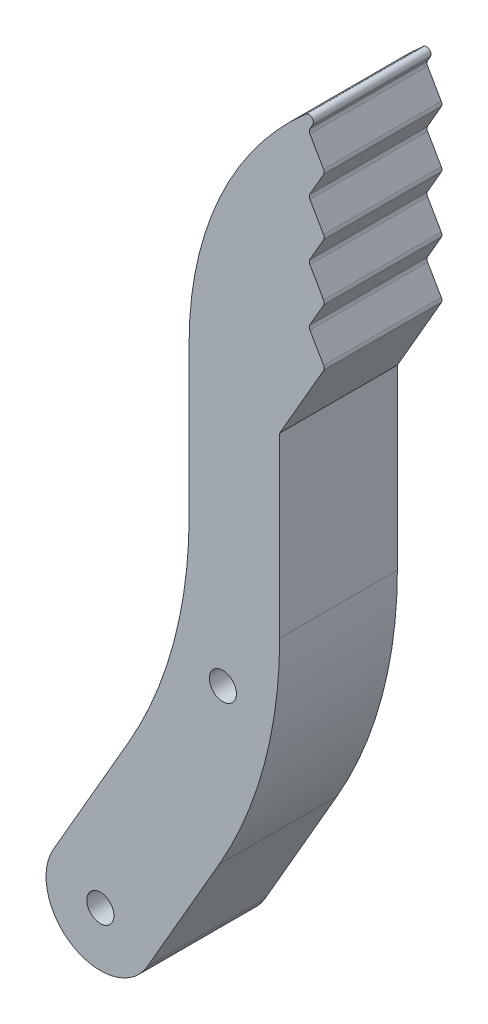
ISO-10303-21;
HEADER;
FILE_DESCRIPTION(('STEP AP214'),'2;1');
FILE_NAME('part.step','',(''),(''),'','','');
FILE_SCHEMA(('AUTOMOTIVE_DESIGN { 1 0 10303 214 1 1 1 1 }'));
ENDSEC;
DATA;
#1=APPLICATION_CONTEXT('core data for automotive mechanical design processes');
#2=APPLICATION_PROTOCOL_DEFINITION('international standard','automotive_design',2000,#1);
#3=PRODUCT_CONTEXT('',#1,'mechanical');
#4=PRODUCT('Part','Part','',(#3));
#5=PRODUCT_RELATED_PRODUCT_CATEGORY('part','',(#4));
#6=PRODUCT_DEFINITION_FORMATION('','',#4);
#7=PRODUCT_DEFINITION_CONTEXT('part definition',#1,'design');
#8=PRODUCT_DEFINITION('design','',#6,#7);
#9=PRODUCT_DEFINITION_SHAPE('','',#8);
#10=(LENGTH_UNIT() NAMED_UNIT(*) SI_UNIT(.MILLI.,.METRE.));
#11=(NAMED_UNIT(*) PLANE_ANGLE_UNIT() SI_UNIT($,.RADIAN.));
#12=(NAMED_UNIT(*) SI_UNIT($,.STERADIAN.) SOLID_ANGLE_UNIT());
#13=UNCERTAINTY_MEASURE_WITH_UNIT(LENGTH_MEASURE(1.E-05),#10,'distance_accuracy_value','');
#14=(GEOMETRIC_REPRESENTATION_CONTEXT(3) GLOBAL_UNCERTAINTY_ASSIGNED_CONTEXT((#13)) GLOBAL_UNIT_ASSIGNED_CONTEXT((#10,
#11,#12)) REPRESENTATION_CONTEXT('',''));
#15=CARTESIAN_POINT('',(0.,0.,0.));
#16=DIRECTION('',(0.,0.,1.));
#17=DIRECTION('',(1.,0.,0.));
#18=AXIS2_PLACEMENT_3D('',#15,#16,#17);
#19=CARTESIAN_POINT('',(3.47243186433413,-2.00480947161596,6.5));
#20=DIRECTION('',(0.866025403784437,-0.500000000000003,0.));
#21=DIRECTION('',(0.500000000000003,0.866025403784437,0.));
#22=AXIS2_PLACEMENT_3D('',#19,#20,#21);
#23=PLANE('',#22);
#24=DIRECTION('',(-0.500000000000003,-0.866025403784437,0.));
#25=VECTOR('',#24,1.);
#26=CARTESIAN_POINT('',(3.47243186433413,-2.00480947161596,-6.5));
#27=LINE('',#26,#25);
#28=CARTESIAN_POINT('',(-11.6987298107781,-28.2820323027519,-6.5));
#29=VERTEX_POINT('',#28);
#30=CARTESIAN_POINT('',(-19.6076951545882,-41.9807621135323,-6.5));
#31=VERTEX_POINT('',#30);
#32=EDGE_CURVE('E219',#29,#31,#27,.T.);
#33=ORIENTED_EDGE('',*,*,#32,.F.);
#34=DIRECTION('',(0.,0.,-1.));
#35=VECTOR('',#34,1.);
#36=CARTESIAN_POINT('',(-11.6987298107781,-28.2820323027519,6.5));
#37=LINE('',#36,#35);
#38=CARTESIAN_POINT('',(-11.6987298107781,-28.2820323027519,6.5));
#39=VERTEX_POINT('',#38);
#40=EDGE_CURVE('E213',#39,#29,#37,.T.);
#41=ORIENTED_EDGE('',*,*,#40,.F.);
#42=DIRECTION('',(-0.500000000000003,-0.866025403784437,0.));
#43=VECTOR('',#42,1.);
#44=CARTESIAN_POINT('',(3.47243186433413,-2.00480947161596,6.5));
#45=LINE('',#44,#43);
#46=CARTESIAN_POINT('',(-19.6076951545882,-41.9807621135323,6.5));
#47=VERTEX_POINT('',#46);
#48=EDGE_CURVE('E216',#39,#47,#45,.T.);
#49=ORIENTED_EDGE('',*,*,#48,.T.);
#50=DIRECTION('',(0.,0.,-1.));
#51=VECTOR('',#50,1.);
#52=CARTESIAN_POINT('',(-19.6076951545882,-41.9807621135323,6.5));
#53=LINE('',#52,#51);
#54=EDGE_CURVE('E283',#47,#31,#53,.T.);
#55=ORIENTED_EDGE('',*,*,#54,.T.);
#56=EDGE_LOOP('',(#33,#41,#49,#55));
#57=FACE_BOUND('',#56,.T.);
#58=ADVANCED_FACE('F38',(#57),#23,.T.);
#59=CARTESIAN_POINT('',(-54.9999999999996,-3.28203230275342,6.5));
#60=DIRECTION('',(0.,0.,-1.));
#61=DIRECTION('',(-1.,0.,0.));
#62=AXIS2_PLACEMENT_3D('',#59,#60,#61);
#63=CYLINDRICAL_SURFACE('',#62,49.9999999999992);
#64=CARTESIAN_POINT('',(-54.9999999999996,-3.28203230275342,-6.5));
#65=DIRECTION('',(0.,0.,1.));
#66=DIRECTION('',(1.,0.,0.));
#67=AXIS2_PLACEMENT_3D('',#64,#65,#66);
#68=CIRCLE('',#67,49.9999999999992);
#69=CARTESIAN_POINT('',(-4.99999999999998,-3.28203230275191,-6.5));
#70=VERTEX_POINT('',#69);
#71=EDGE_CURVE('E291',#29,#70,#68,.T.);
#72=ORIENTED_EDGE('',*,*,#71,.T.);
#73=DIRECTION('',(0.,0.,-1.));
#74=VECTOR('',#73,1.);
#75=CARTESIAN_POINT('',(-4.99999999999998,-3.28203230275191,6.5));
#76=LINE('',#75,#74);
#77=CARTESIAN_POINT('',(-4.99999999999998,-3.28203230275191,6.5));
#78=VERTEX_POINT('',#77);
#79=EDGE_CURVE('E224',#78,#70,#76,.T.);
#80=ORIENTED_EDGE('',*,*,#79,.F.);
#81=CARTESIAN_POINT('',(-54.9999999999996,-3.28203230275342,6.5));
#82=DIRECTION('',(0.,0.,1.));
#83=DIRECTION('',(1.,0.,0.));
#84=AXIS2_PLACEMENT_3D('',#81,#82,#83);
#85=CIRCLE('',#84,49.9999999999992);
#86=EDGE_CURVE('E227',#39,#78,#85,.T.);
#87=ORIENTED_EDGE('',*,*,#86,.F.);
#88=ORIENTED_EDGE('',*,*,#40,.T.);
#89=EDGE_LOOP('',(#72,#80,#87,#88));
#90=FACE_BOUND('',#89,.T.);
#91=ADVANCED_FACE('F228',(#90),#63,.T.);
#92=CARTESIAN_POINT('',(-4.99999999999998,0.,6.5));
#93=DIRECTION('',(1.,0.,0.));
#94=DIRECTION('',(0.,1.,0.));
#95=AXIS2_PLACEMENT_3D('',#92,#93,#94);
#96=PLANE('',#95);
#97=DIRECTION('',(0.,-1.,0.));
#98=VECTOR('',#97,1.);
#99=CARTESIAN_POINT('',(-4.99999999999998,0.,-6.5));
#100=LINE('',#99,#98);
#101=CARTESIAN_POINT('',(-4.99999999999998,16.3397459621556,-6.5));
#102=VERTEX_POINT('',#101);
#103=EDGE_CURVE('E293',#102,#70,#100,.T.);
#104=ORIENTED_EDGE('',*,*,#103,.F.);
#105=DIRECTION('',(0.,0.,-1.));
#106=VECTOR('',#105,1.);
#107=CARTESIAN_POINT('',(-4.99999999999998,16.3397459621556,6.5));
#108=LINE('',#107,#106);
#109=CARTESIAN_POINT('',(-4.99999999999998,16.3397459621556,6.5));
#110=VERTEX_POINT('',#109);
#111=EDGE_CURVE('E346',#110,#102,#108,.T.);
#112=ORIENTED_EDGE('',*,*,#111,.F.);
#113=DIRECTION('',(0.,-1.,0.));
#114=VECTOR('',#113,1.);
#115=CARTESIAN_POINT('',(-4.99999999999998,0.,6.5));
#116=LINE('',#115,#114);
#117=EDGE_CURVE('E231',#110,#78,#116,.T.);
#118=ORIENTED_EDGE('',*,*,#117,.T.);
#119=ORIENTED_EDGE('',*,*,#79,.T.);
#120=EDGE_LOOP('',(#104,#112,#118,#119));
#121=FACE_BOUND('',#120,.T.);
#122=ADVANCED_FACE('F461',(#121),#96,.T.);
#123=CARTESIAN_POINT('',(-10.8253175473055,6.25,6.5));
#124=DIRECTION('',(0.866025403784438,-0.500000000000001,0.));
#125=DIRECTION('',(0.500000000000001,0.866025403784438,0.));
#126=AXIS2_PLACEMENT_3D('',#123,#124,#125);
#127=PLANE('',#126);
#128=DIRECTION('',(-0.500000000000001,-0.866025403784438,0.));
#129=VECTOR('',#128,1.);
#130=CARTESIAN_POINT('',(-10.8253175473055,6.25,-6.5));
#131=LINE('',#130,#129);
#132=CARTESIAN_POINT('',(-0.144337567297382,24.75,-6.5));
#133=VERTEX_POINT('',#132);
#134=EDGE_CURVE('E296',#133,#102,#131,.T.);
#135=ORIENTED_EDGE('',*,*,#134,.F.);
#136=DIRECTION('',(0.,0.,-1.));
#137=VECTOR('',#136,1.);
#138=CARTESIAN_POINT('',(-0.144337567297382,24.75,6.5));
#139=LINE('',#138,#137);
#140=CARTESIAN_POINT('',(-0.144337567297382,24.75,6.5));
#141=VERTEX_POINT('',#140);
#142=EDGE_CURVE('E61',#133,#141,#139,.F.);
#143=ORIENTED_EDGE('',*,*,#142,.T.);
#144=DIRECTION('',(-0.500000000000001,-0.866025403784438,0.));
#145=VECTOR('',#144,1.);
#146=CARTESIAN_POINT('',(-10.8253175473055,6.25,6.5));
#147=LINE('',#146,#145);
#148=EDGE_CURVE('E245',#141,#110,#147,.T.);
#149=ORIENTED_EDGE('',*,*,#148,.T.);
#150=ORIENTED_EDGE('',*,*,#111,.T.);
#151=EDGE_LOOP('',(#135,#143,#149,#150));
#152=FACE_BOUND('',#151,.T.);
#153=ADVANCED_FACE('F744',(#152),#127,.T.);
#154=CARTESIAN_POINT('',(10.8253175473056,6.25000000000012,6.5));
#155=DIRECTION('',(0.866025403784436,0.500000000000004,0.));
#156=DIRECTION('',(-0.500000000000004,0.866025403784436,0.));
#157=AXIS2_PLACEMENT_3D('',#154,#155,#156);
#158=PLANE('',#157);
#159=DIRECTION('',(0.500000000000004,-0.866025403784436,0.));
#160=VECTOR('',#159,1.);
#161=CARTESIAN_POINT('',(10.8253175473056,6.25000000000012,-6.5));
#162=LINE('',#161,#160);
#163=CARTESIAN_POINT('',(-1.65988202392016,27.875,-6.5));
#164=VERTEX_POINT('',#163);
#165=CARTESIAN_POINT('',(-0.144337567297384,25.25,-6.5));
#166=VERTEX_POINT('',#165);
#167=EDGE_CURVE('E298',#164,#166,#162,.T.);
#168=ORIENTED_EDGE('',*,*,#167,.F.);
#169=DIRECTION('',(0.,0.,-1.));
#170=VECTOR('',#169,1.);
#171=CARTESIAN_POINT('',(-1.65988202392016,27.875,6.5));
#172=LINE('',#171,#170);
#173=CARTESIAN_POINT('',(-1.65988202392016,27.875,6.5));
#174=VERTEX_POINT('',#173);
#175=EDGE_CURVE('E357',#164,#174,#172,.F.);
#176=ORIENTED_EDGE('',*,*,#175,.T.);
#177=DIRECTION('',(0.500000000000004,-0.866025403784436,0.));
#178=VECTOR('',#177,1.);
#179=CARTESIAN_POINT('',(10.8253175473056,6.25000000000012,6.5));
#180=LINE('',#179,#178);
#181=CARTESIAN_POINT('',(-0.144337567297384,25.25,6.5));
#182=VERTEX_POINT('',#181);
#183=EDGE_CURVE('E247',#174,#182,#180,.T.);
#184=ORIENTED_EDGE('',*,*,#183,.T.);
#185=DIRECTION('',(0.,0.,-1.));
#186=VECTOR('',#185,1.);
#187=CARTESIAN_POINT('',(-0.144337567297386,25.25,6.5));
#188=LINE('',#187,#186);
#189=EDGE_CURVE('E354',#182,#166,#188,.T.);
#190=ORIENTED_EDGE('',*,*,#189,.T.);
#191=EDGE_LOOP('',(#168,#176,#184,#190));
#192=FACE_BOUND('',#191,.T.);
#193=ADVANCED_FACE('F469',(#192),#158,.T.);
#194=CARTESIAN_POINT('',(-13.5316469341319,7.8125000000001,6.5));
#195=DIRECTION('',(0.866025403784436,-0.500000000000004,0.));
#196=DIRECTION('',(0.500000000000004,0.866025403784437,0.));
#197=AXIS2_PLACEMENT_3D('',#194,#195,#196);
#198=PLANE('',#197);
#199=DIRECTION('',(-0.500000000000004,-0.866025403784437,0.));
#200=VECTOR('',#199,1.);
#201=CARTESIAN_POINT('',(-13.5316469341319,7.8125000000001,6.5));
#202=LINE('',#201,#200);
#203=CARTESIAN_POINT('',(-0.144337567297375,31.,6.5));
#204=VERTEX_POINT('',#203);
#205=CARTESIAN_POINT('',(-1.65988202392016,28.375,6.5));
#206=VERTEX_POINT('',#205);
#207=EDGE_CURVE('E250',#204,#206,#202,.T.);
#208=ORIENTED_EDGE('',*,*,#207,.T.);
#209=DIRECTION('',(0.,0.,-1.));
#210=VECTOR('',#209,1.);
#211=CARTESIAN_POINT('',(-1.65988202392016,28.375,-6.5));
#212=LINE('',#211,#210);
#213=CARTESIAN_POINT('',(-1.65988202392016,28.375,-6.5));
#214=VERTEX_POINT('',#213);
#215=EDGE_CURVE('E351',#206,#214,#212,.T.);
#216=ORIENTED_EDGE('',*,*,#215,.T.);
#217=DIRECTION('',(-0.500000000000004,-0.866025403784437,0.));
#218=VECTOR('',#217,1.);
#219=CARTESIAN_POINT('',(-13.5316469341319,7.8125000000001,-6.5));
#220=LINE('',#219,#218);
#221=CARTESIAN_POINT('',(-0.144337567297375,31.,-6.5));
#222=VERTEX_POINT('',#221);
#223=EDGE_CURVE('E301',#222,#214,#220,.T.);
#224=ORIENTED_EDGE('',*,*,#223,.F.);
#225=DIRECTION('',(0.,0.,-1.));
#226=VECTOR('',#225,1.);
#227=CARTESIAN_POINT('',(-0.144337567297381,31.,6.5));
#228=LINE('',#227,#226);
#229=EDGE_CURVE('E223',#222,#204,#228,.F.);
#230=ORIENTED_EDGE('',*,*,#229,.T.);
#231=EDGE_LOOP('',(#208,#216,#224,#230));
#232=FACE_BOUND('',#231,.T.);
#233=ADVANCED_FACE('F477',(#232),#198,.T.);
#234=CARTESIAN_POINT('',(13.5316469341319,7.81250000000013,6.5));
#235=DIRECTION('',(0.866025403784436,0.500000000000004,0.));
#236=DIRECTION('',(-0.500000000000004,0.866025403784437,0.));
#237=AXIS2_PLACEMENT_3D('',#234,#235,#236);
#238=PLANE('',#237);
#239=DIRECTION('',(0.500000000000004,-0.866025403784436,0.));
#240=VECTOR('',#239,1.);
#241=CARTESIAN_POINT('',(13.5316469341319,7.81250000000013,-6.5));
#242=LINE('',#241,#240);
#243=CARTESIAN_POINT('',(-1.65988202392016,34.125,-6.5));
#244=VERTEX_POINT('',#243);
#245=CARTESIAN_POINT('',(-0.144337567297386,31.5,-6.5));
#246=VERTEX_POINT('',#245);
#247=EDGE_CURVE('E304',#244,#246,#242,.T.);
#248=ORIENTED_EDGE('',*,*,#247,.F.);
#249=DIRECTION('',(0.,0.,-1.));
#250=VECTOR('',#249,1.);
#251=CARTESIAN_POINT('',(-1.65988202392016,34.125,6.5));
#252=LINE('',#251,#250);
#253=CARTESIAN_POINT('',(-1.65988202392016,34.125,6.5));
#254=VERTEX_POINT('',#253);
#255=EDGE_CURVE('E367',#244,#254,#252,.F.);
#256=ORIENTED_EDGE('',*,*,#255,.T.);
#257=DIRECTION('',(0.500000000000004,-0.866025403784436,0.));
#258=VECTOR('',#257,1.);
#259=CARTESIAN_POINT('',(13.5316469341319,7.81250000000013,6.5));
#260=LINE('',#259,#258);
#261=CARTESIAN_POINT('',(-0.144337567297386,31.5,6.5));
#262=VERTEX_POINT('',#261);
#263=EDGE_CURVE('E253',#254,#262,#260,.T.);
#264=ORIENTED_EDGE('',*,*,#263,.T.);
#265=DIRECTION('',(0.,0.,-1.));
#266=VECTOR('',#265,1.);
#267=CARTESIAN_POINT('',(-0.144337567297387,31.5,6.5));
#268=LINE('',#267,#266);
#269=EDGE_CURVE('E364',#262,#246,#268,.T.);
#270=ORIENTED_EDGE('',*,*,#269,.T.);
#271=EDGE_LOOP('',(#248,#256,#264,#270));
#272=FACE_BOUND('',#271,.T.);
#273=ADVANCED_FACE('F487',(#272),#238,.T.);
#274=CARTESIAN_POINT('',(-16.2379763209582,9.37499999999991,6.5));
#275=DIRECTION('',(0.86602540378444,-0.499999999999998,0.));
#276=DIRECTION('',(0.499999999999998,0.86602540378444,0.));
#277=AXIS2_PLACEMENT_3D('',#274,#275,#276);
#278=PLANE('',#277);
#279=DIRECTION('',(-0.499999999999998,-0.86602540378444,0.));
#280=VECTOR('',#279,1.);
#281=CARTESIAN_POINT('',(-16.2379763209582,9.37499999999991,6.5));
#282=LINE('',#281,#280);
#283=CARTESIAN_POINT('',(-0.144337567297391,37.25,6.5));
#284=VERTEX_POINT('',#283);
#285=CARTESIAN_POINT('',(-1.65988202392016,34.625,6.5));
#286=VERTEX_POINT('',#285);
#287=EDGE_CURVE('E256',#284,#286,#282,.T.);
#288=ORIENTED_EDGE('',*,*,#287,.T.);
#289=DIRECTION('',(0.,0.,-1.));
#290=VECTOR('',#289,1.);
#291=CARTESIAN_POINT('',(-1.65988202392016,34.625,-6.5));
#292=LINE('',#291,#290);
#293=CARTESIAN_POINT('',(-1.65988202392016,34.625,-6.5));
#294=VERTEX_POINT('',#293);
#295=EDGE_CURVE('E361',#286,#294,#292,.T.);
#296=ORIENTED_EDGE('',*,*,#295,.T.);
#297=DIRECTION('',(-0.499999999999998,-0.86602540378444,0.));
#298=VECTOR('',#297,1.);
#299=CARTESIAN_POINT('',(-16.2379763209582,9.37499999999991,-6.5));
#300=LINE('',#299,#298);
#301=CARTESIAN_POINT('',(-0.144337567297391,37.25,-6.5));
#302=VERTEX_POINT('',#301);
#303=EDGE_CURVE('E307',#302,#294,#300,.T.);
#304=ORIENTED_EDGE('',*,*,#303,.F.);
#305=DIRECTION('',(0.,0.,-1.));
#306=VECTOR('',#305,1.);
#307=CARTESIAN_POINT('',(-0.144337567297394,37.25,6.5));
#308=LINE('',#307,#306);
#309=EDGE_CURVE('E359',#302,#284,#308,.F.);
#310=ORIENTED_EDGE('',*,*,#309,.T.);
#311=EDGE_LOOP('',(#288,#296,#304,#310));
#312=FACE_BOUND('',#311,.T.);
#313=ADVANCED_FACE('F495',(#312),#278,.T.);
#314=CARTESIAN_POINT('',(16.2379763209582,9.37499999999996,6.5));
#315=DIRECTION('',(0.866025403784439,0.499999999999999,0.));
#316=DIRECTION('',(-0.499999999999999,0.866025403784439,0.));
#317=AXIS2_PLACEMENT_3D('',#314,#315,#316);
#318=PLANE('',#317);
#319=DIRECTION('',(0.499999999999999,-0.866025403784439,0.));
#320=VECTOR('',#319,1.);
#321=CARTESIAN_POINT('',(16.2379763209582,9.37499999999996,-6.5));
#322=LINE('',#321,#320);
#323=CARTESIAN_POINT('',(-1.65988202392016,40.375,-6.5));
#324=VERTEX_POINT('',#323);
#325=CARTESIAN_POINT('',(-0.144337567297401,37.75,-6.5));
#326=VERTEX_POINT('',#325);
#327=EDGE_CURVE('E310',#324,#326,#322,.T.);
#328=ORIENTED_EDGE('',*,*,#327,.F.);
#329=DIRECTION('',(0.,0.,-1.));
#330=VECTOR('',#329,1.);
#331=CARTESIAN_POINT('',(-1.65988202392016,40.375,6.5));
#332=LINE('',#331,#330);
#333=CARTESIAN_POINT('',(-1.65988202392016,40.375,6.5));
#334=VERTEX_POINT('',#333);
#335=EDGE_CURVE('E377',#324,#334,#332,.F.);
#336=ORIENTED_EDGE('',*,*,#335,.T.);
#337=DIRECTION('',(0.499999999999999,-0.866025403784439,0.));
#338=VECTOR('',#337,1.);
#339=CARTESIAN_POINT('',(16.2379763209582,9.37499999999996,6.5));
#340=LINE('',#339,#338);
#341=CARTESIAN_POINT('',(-0.144337567297401,37.75,6.5));
#342=VERTEX_POINT('',#341);
#343=EDGE_CURVE('E259',#334,#342,#340,.T.);
#344=ORIENTED_EDGE('',*,*,#343,.T.);
#345=DIRECTION('',(0.,0.,-1.));
#346=VECTOR('',#345,1.);
#347=CARTESIAN_POINT('',(-0.144337567297401,37.75,6.5));
#348=LINE('',#347,#346);
#349=EDGE_CURVE('E374',#342,#326,#348,.T.);
#350=ORIENTED_EDGE('',*,*,#349,.T.);
#351=EDGE_LOOP('',(#328,#336,#344,#350));
#352=FACE_BOUND('',#351,.T.);
#353=ADVANCED_FACE('F505',(#352),#318,.T.);
#354=CARTESIAN_POINT('',(-18.9443057077847,10.9375000000001,6.5));
#355=DIRECTION('',(0.866025403784436,-0.500000000000004,0.));
#356=DIRECTION('',(0.500000000000004,0.866025403784437,0.));
#357=AXIS2_PLACEMENT_3D('',#354,#355,#356);
#358=PLANE('',#357);
#359=DIRECTION('',(-0.500000000000004,-0.866025403784437,0.));
#360=VECTOR('',#359,1.);
#361=CARTESIAN_POINT('',(-18.9443057077847,10.9375000000001,6.5));
#362=LINE('',#361,#360);
#363=CARTESIAN_POINT('',(-0.144337567297374,43.5,6.5));
#364=VERTEX_POINT('',#363);
#365=CARTESIAN_POINT('',(-1.65988202392015,40.875,6.5));
#366=VERTEX_POINT('',#365);
#367=EDGE_CURVE('E262',#364,#366,#362,.T.);
#368=ORIENTED_EDGE('',*,*,#367,.T.);
#369=DIRECTION('',(0.,0.,-1.));
#370=VECTOR('',#369,1.);
#371=CARTESIAN_POINT('',(-1.65988202392016,40.875,-6.5));
#372=LINE('',#371,#370);
#373=CARTESIAN_POINT('',(-1.65988202392015,40.875,-6.5));
#374=VERTEX_POINT('',#373);
#375=EDGE_CURVE('E371',#366,#374,#372,.T.);
#376=ORIENTED_EDGE('',*,*,#375,.T.);
#377=DIRECTION('',(-0.500000000000004,-0.866025403784437,0.));
#378=VECTOR('',#377,1.);
#379=CARTESIAN_POINT('',(-18.9443057077847,10.9375000000001,-6.5));
#380=LINE('',#379,#378);
#381=CARTESIAN_POINT('',(-0.144337567297374,43.5,-6.5));
#382=VERTEX_POINT('',#381);
#383=EDGE_CURVE('E313',#382,#374,#380,.T.);
#384=ORIENTED_EDGE('',*,*,#383,.F.);
#385=DIRECTION('',(0.,0.,-1.));
#386=VECTOR('',#385,1.);
#387=CARTESIAN_POINT('',(-0.144337567297381,43.5,6.5));
#388=LINE('',#387,#386);
#389=EDGE_CURVE('E369',#382,#364,#388,.F.);
#390=ORIENTED_EDGE('',*,*,#389,.T.);
#391=EDGE_LOOP('',(#368,#376,#384,#390));
#392=FACE_BOUND('',#391,.T.);
#393=ADVANCED_FACE('F513',(#392),#358,.T.);
#394=CARTESIAN_POINT('',(18.9443057077847,10.9375000000002,6.5));
#395=DIRECTION('',(0.866025403784437,0.500000000000003,0.));
#396=DIRECTION('',(-0.500000000000003,0.866025403784437,0.));
#397=AXIS2_PLACEMENT_3D('',#394,#395,#396);
#398=PLANE('',#397);
#399=DIRECTION('',(0.500000000000003,-0.866025403784437,0.));
#400=VECTOR('',#399,1.);
#401=CARTESIAN_POINT('',(18.9443057077847,10.9375000000002,-6.5));
#402=LINE('',#401,#400);
#403=CARTESIAN_POINT('',(-1.65988202392016,46.625,-6.5));
#404=VERTEX_POINT('',#403);
#405=CARTESIAN_POINT('',(-0.14433756729737,44.,-6.5));
#406=VERTEX_POINT('',#405);
#407=EDGE_CURVE('E316',#404,#406,#402,.T.);
#408=ORIENTED_EDGE('',*,*,#407,.F.);
#409=DIRECTION('',(0.,0.,-1.));
#410=VECTOR('',#409,1.);
#411=CARTESIAN_POINT('',(-1.65988202392016,46.625,6.5));
#412=LINE('',#411,#410);
#413=CARTESIAN_POINT('',(-1.65988202392016,46.625,6.5));
#414=VERTEX_POINT('',#413);
#415=EDGE_CURVE('E387',#404,#414,#412,.F.);
#416=ORIENTED_EDGE('',*,*,#415,.T.);
#417=DIRECTION('',(0.500000000000003,-0.866025403784437,0.));
#418=VECTOR('',#417,1.);
#419=CARTESIAN_POINT('',(18.9443057077847,10.9375000000002,6.5));
#420=LINE('',#419,#418);
#421=CARTESIAN_POINT('',(-0.14433756729737,44.,6.5));
#422=VERTEX_POINT('',#421);
#423=EDGE_CURVE('E265',#414,#422,#420,.T.);
#424=ORIENTED_EDGE('',*,*,#423,.T.);
#425=DIRECTION('',(0.,0.,-1.));
#426=VECTOR('',#425,1.);
#427=CARTESIAN_POINT('',(-0.14433756729737,44.,6.5));
#428=LINE('',#427,#426);
#429=EDGE_CURVE('E384',#422,#406,#428,.T.);
#430=ORIENTED_EDGE('',*,*,#429,.T.);
#431=EDGE_LOOP('',(#408,#416,#424,#430));
#432=FACE_BOUND('',#431,.T.);
#433=ADVANCED_FACE('F431',(#432),#398,.T.);
#434=CARTESIAN_POINT('',(-21.6506350946109,12.4999999999999,6.5));
#435=DIRECTION('',(0.86602540378444,-0.499999999999997,0.));
#436=DIRECTION('',(0.499999999999997,0.86602540378444,0.));
#437=AXIS2_PLACEMENT_3D('',#434,#435,#436);
#438=PLANE('',#437);
#439=DIRECTION('',(-0.499999999999997,-0.86602540378444,0.));
#440=VECTOR('',#439,1.);
#441=CARTESIAN_POINT('',(-21.6506350946109,12.4999999999999,6.5));
#442=LINE('',#441,#440);
#443=CARTESIAN_POINT('',(-1.34438070673431,47.6714643112208,6.5));
#444=VERTEX_POINT('',#443);
#445=CARTESIAN_POINT('',(-1.65988202392016,47.125,6.5));
#446=VERTEX_POINT('',#445);
#447=EDGE_CURVE('E268',#444,#446,#442,.T.);
#448=ORIENTED_EDGE('',*,*,#447,.T.);
#449=DIRECTION('',(0.,0.,-1.));
#450=VECTOR('',#449,1.);
#451=CARTESIAN_POINT('',(-1.65988202392016,47.125,-6.5));
#452=LINE('',#451,#450);
#453=CARTESIAN_POINT('',(-1.65988202392016,47.125,-6.5));
#454=VERTEX_POINT('',#453);
#455=EDGE_CURVE('E381',#446,#454,#452,.T.);
#456=ORIENTED_EDGE('',*,*,#455,.T.);
#457=DIRECTION('',(-0.499999999999997,-0.86602540378444,0.));
#458=VECTOR('',#457,1.);
#459=CARTESIAN_POINT('',(-21.6506350946109,12.4999999999999,-6.5));
#460=LINE('',#459,#458);
#461=CARTESIAN_POINT('',(-1.34438070673431,47.6714643112208,-6.5));
#462=VERTEX_POINT('',#461);
#463=EDGE_CURVE('E319',#462,#454,#460,.T.);
#464=ORIENTED_EDGE('',*,*,#463,.F.);
#465=DIRECTION('',(0.,0.,-1.));
#466=VECTOR('',#465,1.);
#467=CARTESIAN_POINT('',(-1.34438070673431,47.6714643112208,6.5));
#468=LINE('',#467,#466);
#469=EDGE_CURVE('E379',#462,#444,#468,.F.);
#470=ORIENTED_EDGE('',*,*,#469,.T.);
#471=EDGE_LOOP('',(#448,#456,#464,#470));
#472=FACE_BOUND('',#471,.T.);
#473=ADVANCED_FACE('F437',(#472),#438,.T.);
#474=CARTESIAN_POINT('',(22.5,20.,6.5));
#475=DIRECTION('',(0.,0.,-1.));
#476=DIRECTION('',(-1.,0.,0.));
#477=AXIS2_PLACEMENT_3D('',#474,#475,#476);
#478=CYLINDRICAL_SURFACE('',#477,37.5);
#479=CARTESIAN_POINT('',(22.5,20.,6.5));
#480=DIRECTION('',(0.,0.,1.));
#481=DIRECTION('',(1.,0.,0.));
#482=AXIS2_PLACEMENT_3D('',#479,#480,#481);
#483=CIRCLE('',#482,37.5);
#484=CARTESIAN_POINT('',(-15.,20.,6.5));
#485=VERTEX_POINT('',#484);
#486=CARTESIAN_POINT('',(-2.1054662925269,48.2987813965076,6.5));
#487=VERTEX_POINT('',#486);
#488=EDGE_CURVE('E271',#485,#487,#483,.F.);
#489=ORIENTED_EDGE('',*,*,#488,.T.);
#490=DIRECTION('',(0.,0.,-1.));
#491=VECTOR('',#490,1.);
#492=CARTESIAN_POINT('',(-2.10546629252689,48.2987813965076,6.5));
#493=LINE('',#492,#491);
#494=CARTESIAN_POINT('',(-2.1054662925269,48.2987813965076,-6.5));
#495=VERTEX_POINT('',#494);
#496=EDGE_CURVE('E409',#487,#495,#493,.T.);
#497=ORIENTED_EDGE('',*,*,#496,.T.);
#498=CARTESIAN_POINT('',(22.5,20.,-6.5));
#499=DIRECTION('',(0.,0.,1.));
#500=DIRECTION('',(1.,0.,0.));
#501=AXIS2_PLACEMENT_3D('',#498,#499,#500);
#502=CIRCLE('',#501,37.5);
#503=CARTESIAN_POINT('',(-15.,20.,-6.5));
#504=VERTEX_POINT('',#503);
#505=EDGE_CURVE('E322',#504,#495,#502,.F.);
#506=ORIENTED_EDGE('',*,*,#505,.F.);
#507=DIRECTION('',(0.,0.,-1.));
#508=VECTOR('',#507,1.);
#509=CARTESIAN_POINT('',(-15.,20.,6.5));
#510=LINE('',#509,#508);
#511=EDGE_CURVE('E344',#485,#504,#510,.T.);
#512=ORIENTED_EDGE('',*,*,#511,.F.);
#513=EDGE_LOOP('',(#489,#497,#506,#512));
#514=FACE_BOUND('',#513,.T.);
#515=ADVANCED_FACE('F443',(#514),#478,.T.);
#516=CARTESIAN_POINT('',(-15.,0.,6.5));
#517=DIRECTION('',(-1.,0.,0.));
#518=DIRECTION('',(0.,-1.,0.));
#519=AXIS2_PLACEMENT_3D('',#516,#517,#518);
#520=PLANE('',#519);
#521=DIRECTION('',(0.,1.,0.));
#522=VECTOR('',#521,1.);
#523=CARTESIAN_POINT('',(-15.,0.,-6.5));
#524=LINE('',#523,#522);
#525=CARTESIAN_POINT('',(-15.,3.39745962155624,-6.5));
#526=VERTEX_POINT('',#525);
#527=EDGE_CURVE('E325',#526,#504,#524,.T.);
#528=ORIENTED_EDGE('',*,*,#527,.F.);
#529=DIRECTION('',(0.,0.,-1.));
#530=VECTOR('',#529,1.);
#531=CARTESIAN_POINT('',(-15.,3.39745962155624,6.5));
#532=LINE('',#531,#530);
#533=CARTESIAN_POINT('',(-15.,3.39745962155624,6.5));
#534=VERTEX_POINT('',#533);
#535=EDGE_CURVE('E342',#534,#526,#532,.T.);
#536=ORIENTED_EDGE('',*,*,#535,.F.);
#537=DIRECTION('',(0.,1.,0.));
#538=VECTOR('',#537,1.);
#539=CARTESIAN_POINT('',(-15.,0.,6.5));
#540=LINE('',#539,#538);
#541=EDGE_CURVE('E273',#534,#485,#540,.T.);
#542=ORIENTED_EDGE('',*,*,#541,.T.);
#543=ORIENTED_EDGE('',*,*,#511,.T.);
#544=EDGE_LOOP('',(#528,#536,#542,#543));
#545=FACE_BOUND('',#544,.T.);
#546=ADVANCED_FACE('F447',(#545),#520,.T.);
#547=CARTESIAN_POINT('',(-65.,3.39745962155773,6.5));
#548=DIRECTION('',(0.,0.,-1.));
#549=DIRECTION('',(-1.,0.,0.));
#550=AXIS2_PLACEMENT_3D('',#547,#548,#549);
#551=CYLINDRICAL_SURFACE('',#550,50.);
#552=CARTESIAN_POINT('',(-65.,3.39745962155773,-6.5));
#553=DIRECTION('',(0.,0.,1.));
#554=DIRECTION('',(1.,0.,0.));
#555=AXIS2_PLACEMENT_3D('',#552,#553,#554);
#556=CIRCLE('',#555,50.);
#557=CARTESIAN_POINT('',(-21.6987298107781,-21.6025403784424,-6.5));
#558=VERTEX_POINT('',#557);
#559=EDGE_CURVE('E328',#558,#526,#556,.T.);
#560=ORIENTED_EDGE('',*,*,#559,.F.);
#561=DIRECTION('',(0.,0.,-1.));
#562=VECTOR('',#561,1.);
#563=CARTESIAN_POINT('',(-21.6987298107781,-21.6025403784424,6.5));
#564=LINE('',#563,#562);
#565=CARTESIAN_POINT('',(-21.6987298107781,-21.6025403784424,6.5));
#566=VERTEX_POINT('',#565);
#567=EDGE_CURVE('E340',#566,#558,#564,.T.);
#568=ORIENTED_EDGE('',*,*,#567,.F.);
#569=CARTESIAN_POINT('',(-65.,3.39745962155773,6.5));
#570=DIRECTION('',(0.,0.,1.));
#571=DIRECTION('',(1.,0.,0.));
#572=AXIS2_PLACEMENT_3D('',#569,#570,#571);
#573=CIRCLE('',#572,50.);
#574=EDGE_CURVE('E276',#566,#534,#573,.T.);
#575=ORIENTED_EDGE('',*,*,#574,.T.);
#576=ORIENTED_EDGE('',*,*,#535,.T.);
#577=EDGE_LOOP('',(#560,#568,#575,#576));
#578=FACE_BOUND('',#577,.T.);
#579=ADVANCED_FACE('F451',(#578),#551,.F.);
#580=CARTESIAN_POINT('',(-6.91987298107838,3.99519052838365,6.5));
#581=DIRECTION('',(-0.866025403784437,0.500000000000003,0.));
#582=DIRECTION('',(-0.500000000000003,-0.866025403784437,0.));
#583=AXIS2_PLACEMENT_3D('',#580,#581,#582);
#584=PLANE('',#583);
#585=DIRECTION('',(0.500000000000003,0.866025403784437,0.));
#586=VECTOR('',#585,1.);
#587=CARTESIAN_POINT('',(-6.91987298107838,3.99519052838365,-6.5));
#588=LINE('',#587,#586);
#589=CARTESIAN_POINT('',(-30.0000000000007,-35.9807621135327,-6.5));
#590=VERTEX_POINT('',#589);
#591=EDGE_CURVE('E331',#590,#558,#588,.T.);
#592=ORIENTED_EDGE('',*,*,#591,.F.);
#593=DIRECTION('',(0.,0.,-1.));
#594=VECTOR('',#593,1.);
#595=CARTESIAN_POINT('',(-30.0000000000007,-35.9807621135327,6.5));
#596=LINE('',#595,#594);
#597=CARTESIAN_POINT('',(-30.0000000000007,-35.9807621135327,6.5));
#598=VERTEX_POINT('',#597);
#599=EDGE_CURVE('E338',#598,#590,#596,.T.);
#600=ORIENTED_EDGE('',*,*,#599,.F.);
#601=DIRECTION('',(0.500000000000003,0.866025403784437,0.));
#602=VECTOR('',#601,1.);
#603=CARTESIAN_POINT('',(-6.91987298107838,3.99519052838365,6.5));
#604=LINE('',#603,#602);
#605=EDGE_CURVE('E279',#598,#566,#604,.T.);
#606=ORIENTED_EDGE('',*,*,#605,.T.);
#607=ORIENTED_EDGE('',*,*,#567,.T.);
#608=EDGE_LOOP('',(#592,#600,#606,#607));
#609=FACE_BOUND('',#608,.T.);
#610=ADVANCED_FACE('F454',(#609),#584,.T.);
#611=CARTESIAN_POINT('',(-24.8038475772938,-38.9807621135329,6.5));
#612=DIRECTION('',(0.,0.,-1.));
#613=DIRECTION('',(-1.,0.,0.));
#614=AXIS2_PLACEMENT_3D('',#611,#612,#613);
#615=CYLINDRICAL_SURFACE('',#614,1.5);
#616=CARTESIAN_POINT('',(-24.8038475772938,-38.9807621135329,6.5));
#617=DIRECTION('',(0.,0.,1.));
#618=DIRECTION('',(1.,0.,0.));
#619=AXIS2_PLACEMENT_3D('',#616,#617,#618);
#620=CIRCLE('',#619,1.5);
#621=CARTESIAN_POINT('',(-23.3038475772938,-38.9807621135329,6.5));
#622=VERTEX_POINT('',#621);
#623=EDGE_CURVE('E237',#622,#622,#620,.T.);
#624=ORIENTED_EDGE('',*,*,#623,.T.);
#625=EDGE_LOOP('',(#624));
#626=FACE_BOUND('',#625,.T.);
#627=CARTESIAN_POINT('',(-24.8038475772938,-38.9807621135329,-6.5));
#628=DIRECTION('',(0.,0.,1.));
#629=DIRECTION('',(1.,0.,0.));
#630=AXIS2_PLACEMENT_3D('',#627,#628,#629);
#631=CIRCLE('',#630,1.5);
#632=CARTESIAN_POINT('',(-23.3038475772938,-38.9807621135329,-6.5));
#633=VERTEX_POINT('',#632);
#634=EDGE_CURVE('E287',#633,#633,#631,.T.);
#635=ORIENTED_EDGE('',*,*,#634,.F.);
#636=EDGE_LOOP('',(#635));
#637=FACE_BOUND('',#636,.T.);
#638=ADVANCED_FACE('F533',(#626,#637),#615,.F.);
#639=CARTESIAN_POINT('',(-11.275914322183,-10.9978657499154,6.5));
#640=DIRECTION('',(0.,0.,-1.));
#641=DIRECTION('',(-1.,0.,0.));
#642=AXIS2_PLACEMENT_3D('',#639,#640,#641);
#643=CYLINDRICAL_SURFACE('',#642,1.5);
#644=CARTESIAN_POINT('',(-11.275914322183,-10.9978657499154,6.5));
#645=DIRECTION('',(0.,0.,1.));
#646=DIRECTION('',(1.,0.,0.));
#647=AXIS2_PLACEMENT_3D('',#644,#645,#646);
#648=CIRCLE('',#647,1.5);
#649=CARTESIAN_POINT('',(-9.775914322183,-10.9978657499154,6.5));
#650=VERTEX_POINT('',#649);
#651=EDGE_CURVE('E240',#650,#650,#648,.T.);
#652=ORIENTED_EDGE('',*,*,#651,.T.);
#653=EDGE_LOOP('',(#652));
#654=FACE_BOUND('',#653,.T.);
#655=CARTESIAN_POINT('',(-11.275914322183,-10.9978657499154,-6.5));
#656=DIRECTION('',(0.,0.,1.));
#657=DIRECTION('',(1.,0.,0.));
#658=AXIS2_PLACEMENT_3D('',#655,#656,#657);
#659=CIRCLE('',#658,1.5);
#660=CARTESIAN_POINT('',(-9.775914322183,-10.9978657499154,-6.5));
#661=VERTEX_POINT('',#660);
#662=EDGE_CURVE('E284',#661,#661,#659,.T.);
#663=ORIENTED_EDGE('',*,*,#662,.F.);
#664=EDGE_LOOP('',(#663));
#665=FACE_BOUND('',#664,.T.);
#666=ADVANCED_FACE('F536',(#654,#665),#643,.F.);
#667=CARTESIAN_POINT('',(-24.8038475772938,-38.9807621135329,6.5));
#668=DIRECTION('',(0.,0.,-1.));
#669=DIRECTION('',(-1.,0.,0.));
#670=AXIS2_PLACEMENT_3D('',#667,#668,#669);
#671=CYLINDRICAL_SURFACE('',#670,5.99999999999958);
#672=CARTESIAN_POINT('',(-24.8038475772938,-38.9807621135329,-6.5));
#673=DIRECTION('',(0.,0.,1.));
#674=DIRECTION('',(1.,0.,0.));
#675=AXIS2_PLACEMENT_3D('',#672,#673,#674);
#676=CIRCLE('',#675,5.99999999999958);
#677=EDGE_CURVE('E334',#31,#590,#676,.F.);
#678=ORIENTED_EDGE('',*,*,#677,.F.);
#679=ORIENTED_EDGE('',*,*,#54,.F.);
#680=CARTESIAN_POINT('',(-24.8038475772938,-38.9807621135329,6.5));
#681=DIRECTION('',(0.,0.,1.));
#682=DIRECTION('',(1.,0.,0.));
#683=AXIS2_PLACEMENT_3D('',#680,#681,#682);
#684=CIRCLE('',#683,5.99999999999958);
#685=EDGE_CURVE('E236',#47,#598,#684,.F.);
#686=ORIENTED_EDGE('',*,*,#685,.T.);
#687=ORIENTED_EDGE('',*,*,#599,.T.);
#688=EDGE_LOOP('',(#678,#679,#686,#687));
#689=FACE_BOUND('',#688,.T.);
#690=ADVANCED_FACE('F457',(#689),#671,.T.);
#691=CARTESIAN_POINT('',(0.,0.,6.5));
#692=DIRECTION('',(0.,0.,1.));
#693=DIRECTION('',(1.,0.,0.));
#694=AXIS2_PLACEMENT_3D('',#691,#692,#693);
#695=PLANE('',#694);
#696=ORIENTED_EDGE('',*,*,#651,.F.);
#697=EDGE_LOOP('',(#696));
#698=FACE_BOUND('',#697,.T.);
#699=ORIENTED_EDGE('',*,*,#623,.F.);
#700=EDGE_LOOP('',(#699));
#701=FACE_BOUND('',#700,.T.);
#702=ORIENTED_EDGE('',*,*,#148,.F.);
#703=CARTESIAN_POINT('',(-0.577350269189602,25.,6.5));
#704=DIRECTION('',(0.,0.,1.));
#705=DIRECTION('',(1.,0.,0.));
#706=AXIS2_PLACEMENT_3D('',#703,#704,#705);
#707=CIRCLE('',#706,0.5);
#708=EDGE_CURVE('E407',#141,#182,#707,.T.);
#709=ORIENTED_EDGE('',*,*,#708,.T.);
#710=ORIENTED_EDGE('',*,*,#183,.F.);
#711=CARTESIAN_POINT('',(-1.22686932202794,28.125,6.5));
#712=DIRECTION('',(0.,0.,1.));
#713=DIRECTION('',(1.,0.,0.));
#714=AXIS2_PLACEMENT_3D('',#711,#712,#713);
#715=CIRCLE('',#714,0.5);
#716=EDGE_CURVE('E414',#174,#206,#715,.F.);
#717=ORIENTED_EDGE('',*,*,#716,.T.);
#718=ORIENTED_EDGE('',*,*,#207,.F.);
#719=CARTESIAN_POINT('',(-0.577350269189604,31.25,6.5));
#720=DIRECTION('',(0.,0.,1.));
#721=DIRECTION('',(1.,0.,0.));
#722=AXIS2_PLACEMENT_3D('',#719,#720,#721);
#723=CIRCLE('',#722,0.5);
#724=EDGE_CURVE('E405',#204,#262,#723,.T.);
#725=ORIENTED_EDGE('',*,*,#724,.T.);
#726=ORIENTED_EDGE('',*,*,#263,.F.);
#727=CARTESIAN_POINT('',(-1.22686932202794,34.375,6.5));
#728=DIRECTION('',(0.,0.,1.));
#729=DIRECTION('',(1.,0.,0.));
#730=AXIS2_PLACEMENT_3D('',#727,#728,#729);
#731=CIRCLE('',#730,0.5);
#732=EDGE_CURVE('E418',#254,#286,#731,.F.);
#733=ORIENTED_EDGE('',*,*,#732,.T.);
#734=ORIENTED_EDGE('',*,*,#287,.F.);
#735=CARTESIAN_POINT('',(-0.577350269189616,37.5,6.5));
#736=DIRECTION('',(0.,0.,1.));
#737=DIRECTION('',(1.,0.,0.));
#738=AXIS2_PLACEMENT_3D('',#735,#736,#737);
#739=CIRCLE('',#738,0.5);
#740=EDGE_CURVE('E403',#284,#342,#739,.T.);
#741=ORIENTED_EDGE('',*,*,#740,.T.);
#742=ORIENTED_EDGE('',*,*,#343,.F.);
#743=CARTESIAN_POINT('',(-1.22686932202794,40.625,6.5));
#744=DIRECTION('',(0.,0.,1.));
#745=DIRECTION('',(1.,0.,0.));
#746=AXIS2_PLACEMENT_3D('',#743,#744,#745);
#747=CIRCLE('',#746,0.5);
#748=EDGE_CURVE('E422',#334,#366,#747,.F.);
#749=ORIENTED_EDGE('',*,*,#748,.T.);
#750=ORIENTED_EDGE('',*,*,#367,.F.);
#751=CARTESIAN_POINT('',(-0.577350269189592,43.75,6.5));
#752=DIRECTION('',(0.,0.,1.));
#753=DIRECTION('',(1.,0.,0.));
#754=AXIS2_PLACEMENT_3D('',#751,#752,#753);
#755=CIRCLE('',#754,0.5);
#756=EDGE_CURVE('E401',#364,#422,#755,.T.);
#757=ORIENTED_EDGE('',*,*,#756,.T.);
#758=ORIENTED_EDGE('',*,*,#423,.F.);
#759=CARTESIAN_POINT('',(-1.22686932202794,46.875,6.5));
#760=DIRECTION('',(0.,0.,1.));
#761=DIRECTION('',(1.,0.,0.));
#762=AXIS2_PLACEMENT_3D('',#759,#760,#761);
#763=CIRCLE('',#762,0.5);
#764=EDGE_CURVE('E11',#414,#446,#763,.F.);
#765=ORIENTED_EDGE('',*,*,#764,.T.);
#766=ORIENTED_EDGE('',*,*,#447,.F.);
#767=CARTESIAN_POINT('',(-1.77739340862654,47.9214643112208,6.5));
#768=DIRECTION('',(0.,0.,1.));
#769=DIRECTION('',(1.,0.,0.));
#770=AXIS2_PLACEMENT_3D('',#767,#768,#769);
#771=CIRCLE('',#770,0.5);
#772=EDGE_CURVE('E53',#444,#487,#771,.T.);
#773=ORIENTED_EDGE('',*,*,#772,.T.);
#774=ORIENTED_EDGE('',*,*,#488,.F.);
#775=ORIENTED_EDGE('',*,*,#541,.F.);
#776=ORIENTED_EDGE('',*,*,#574,.F.);
#777=ORIENTED_EDGE('',*,*,#605,.F.);
#778=ORIENTED_EDGE('',*,*,#685,.F.);
#779=ORIENTED_EDGE('',*,*,#48,.F.);
#780=ORIENTED_EDGE('',*,*,#86,.T.);
#781=ORIENTED_EDGE('',*,*,#117,.F.);
#782=EDGE_LOOP('',(#702,#709,#710,#717,#718,#725,#726,#733,#734,#741,#742,#749,#750,#757,#758,
#765,#766,#773,#774,#775,#776,#777,#778,#779,#780,#781));
#783=FACE_BOUND('',#782,.T.);
#784=ADVANCED_FACE('F233',(#698,#701,#783),#695,.T.);
#785=CARTESIAN_POINT('',(0.,0.,-6.5));
#786=DIRECTION('',(0.,0.,1.));
#787=DIRECTION('',(1.,0.,0.));
#788=AXIS2_PLACEMENT_3D('',#785,#786,#787);
#789=PLANE('',#788);
#790=ORIENTED_EDGE('',*,*,#662,.T.);
#791=EDGE_LOOP('',(#790));
#792=FACE_BOUND('',#791,.T.);
#793=ORIENTED_EDGE('',*,*,#634,.T.);
#794=EDGE_LOOP('',(#793));
#795=FACE_BOUND('',#794,.T.);
#796=ORIENTED_EDGE('',*,*,#167,.T.);
#797=CARTESIAN_POINT('',(-0.577350269189602,25.,-6.5));
#798=DIRECTION('',(0.,0.,1.));
#799=DIRECTION('',(1.,0.,0.));
#800=AXIS2_PLACEMENT_3D('',#797,#798,#799);
#801=CIRCLE('',#800,0.5);
#802=EDGE_CURVE('E397',#166,#133,#801,.F.);
#803=ORIENTED_EDGE('',*,*,#802,.T.);
#804=ORIENTED_EDGE('',*,*,#134,.T.);
#805=ORIENTED_EDGE('',*,*,#103,.T.);
#806=ORIENTED_EDGE('',*,*,#71,.F.);
#807=ORIENTED_EDGE('',*,*,#32,.T.);
#808=ORIENTED_EDGE('',*,*,#677,.T.);
#809=ORIENTED_EDGE('',*,*,#591,.T.);
#810=ORIENTED_EDGE('',*,*,#559,.T.);
#811=ORIENTED_EDGE('',*,*,#527,.T.);
#812=ORIENTED_EDGE('',*,*,#505,.T.);
#813=CARTESIAN_POINT('',(-1.77739340862654,47.9214643112208,-6.5));
#814=DIRECTION('',(0.,0.,1.));
#815=DIRECTION('',(1.,0.,0.));
#816=AXIS2_PLACEMENT_3D('',#813,#814,#815);
#817=CIRCLE('',#816,0.5);
#818=EDGE_CURVE('E389',#495,#462,#817,.F.);
#819=ORIENTED_EDGE('',*,*,#818,.T.);
#820=ORIENTED_EDGE('',*,*,#463,.T.);
#821=CARTESIAN_POINT('',(-1.22686932202794,46.875,-6.5));
#822=DIRECTION('',(0.,0.,1.));
#823=DIRECTION('',(1.,0.,0.));
#824=AXIS2_PLACEMENT_3D('',#821,#822,#823);
#825=CIRCLE('',#824,0.5);
#826=EDGE_CURVE('E46',#454,#404,#825,.T.);
#827=ORIENTED_EDGE('',*,*,#826,.T.);
#828=ORIENTED_EDGE('',*,*,#407,.T.);
#829=CARTESIAN_POINT('',(-0.577350269189592,43.75,-6.5));
#830=DIRECTION('',(0.,0.,1.));
#831=DIRECTION('',(1.,0.,0.));
#832=AXIS2_PLACEMENT_3D('',#829,#830,#831);
#833=CIRCLE('',#832,0.5);
#834=EDGE_CURVE('E391',#406,#382,#833,.F.);
#835=ORIENTED_EDGE('',*,*,#834,.T.);
#836=ORIENTED_EDGE('',*,*,#383,.T.);
#837=CARTESIAN_POINT('',(-1.22686932202794,40.625,-6.5));
#838=DIRECTION('',(0.,0.,1.));
#839=DIRECTION('',(1.,0.,0.));
#840=AXIS2_PLACEMENT_3D('',#837,#838,#839);
#841=CIRCLE('',#840,0.5);
#842=EDGE_CURVE('E420',#374,#324,#841,.T.);
#843=ORIENTED_EDGE('',*,*,#842,.T.);
#844=ORIENTED_EDGE('',*,*,#327,.T.);
#845=CARTESIAN_POINT('',(-0.577350269189616,37.5,-6.5));
#846=DIRECTION('',(0.,0.,1.));
#847=DIRECTION('',(1.,0.,0.));
#848=AXIS2_PLACEMENT_3D('',#845,#846,#847);
#849=CIRCLE('',#848,0.5);
#850=EDGE_CURVE('E393',#326,#302,#849,.F.);
#851=ORIENTED_EDGE('',*,*,#850,.T.);
#852=ORIENTED_EDGE('',*,*,#303,.T.);
#853=CARTESIAN_POINT('',(-1.22686932202794,34.375,-6.5));
#854=DIRECTION('',(0.,0.,1.));
#855=DIRECTION('',(1.,0.,0.));
#856=AXIS2_PLACEMENT_3D('',#853,#854,#855);
#857=CIRCLE('',#856,0.5);
#858=EDGE_CURVE('E416',#294,#244,#857,.T.);
#859=ORIENTED_EDGE('',*,*,#858,.T.);
#860=ORIENTED_EDGE('',*,*,#247,.T.);
#861=CARTESIAN_POINT('',(-0.577350269189604,31.25,-6.5));
#862=DIRECTION('',(0.,0.,1.));
#863=DIRECTION('',(1.,0.,0.));
#864=AXIS2_PLACEMENT_3D('',#861,#862,#863);
#865=CIRCLE('',#864,0.5);
#866=EDGE_CURVE('E395',#246,#222,#865,.F.);
#867=ORIENTED_EDGE('',*,*,#866,.T.);
#868=ORIENTED_EDGE('',*,*,#223,.T.);
#869=CARTESIAN_POINT('',(-1.22686932202794,28.125,-6.5));
#870=DIRECTION('',(0.,0.,1.));
#871=DIRECTION('',(1.,0.,0.));
#872=AXIS2_PLACEMENT_3D('',#869,#870,#871);
#873=CIRCLE('',#872,0.5);
#874=EDGE_CURVE('E412',#214,#164,#873,.T.);
#875=ORIENTED_EDGE('',*,*,#874,.T.);
#876=EDGE_LOOP('',(#796,#803,#804,#805,#806,#807,#808,#809,#810,#811,#812,#819,#820,#827,#828,
#835,#836,#843,#844,#851,#852,#859,#860,#867,#868,#875));
#877=FACE_BOUND('',#876,.T.);
#878=ADVANCED_FACE('F425',(#792,#795,#877),#789,.F.);
#879=CARTESIAN_POINT('',(-1.22686932202794,28.125,6.5));
#880=DIRECTION('',(0.,0.,1.));
#881=DIRECTION('',(1.,0.,0.));
#882=AXIS2_PLACEMENT_3D('',#879,#880,#881);
#883=CYLINDRICAL_SURFACE('',#882,0.5);
#884=ORIENTED_EDGE('',*,*,#716,.F.);
#885=ORIENTED_EDGE('',*,*,#175,.F.);
#886=ORIENTED_EDGE('',*,*,#874,.F.);
#887=ORIENTED_EDGE('',*,*,#215,.F.);
#888=EDGE_LOOP('',(#884,#885,#886,#887));
#889=FACE_BOUND('',#888,.T.);
#890=ADVANCED_FACE('F475',(#889),#883,.F.);
#891=CARTESIAN_POINT('',(-1.22686932202794,34.375,6.5));
#892=DIRECTION('',(0.,0.,1.));
#893=DIRECTION('',(1.,0.,0.));
#894=AXIS2_PLACEMENT_3D('',#891,#892,#893);
#895=CYLINDRICAL_SURFACE('',#894,0.5);
#896=ORIENTED_EDGE('',*,*,#732,.F.);
#897=ORIENTED_EDGE('',*,*,#255,.F.);
#898=ORIENTED_EDGE('',*,*,#858,.F.);
#899=ORIENTED_EDGE('',*,*,#295,.F.);
#900=EDGE_LOOP('',(#896,#897,#898,#899));
#901=FACE_BOUND('',#900,.T.);
#902=ADVANCED_FACE('F493',(#901),#895,.F.);
#903=CARTESIAN_POINT('',(-1.22686932202794,40.625,6.5));
#904=DIRECTION('',(0.,0.,1.));
#905=DIRECTION('',(1.,0.,0.));
#906=AXIS2_PLACEMENT_3D('',#903,#904,#905);
#907=CYLINDRICAL_SURFACE('',#906,0.5);
#908=ORIENTED_EDGE('',*,*,#748,.F.);
#909=ORIENTED_EDGE('',*,*,#335,.F.);
#910=ORIENTED_EDGE('',*,*,#842,.F.);
#911=ORIENTED_EDGE('',*,*,#375,.F.);
#912=EDGE_LOOP('',(#908,#909,#910,#911));
#913=FACE_BOUND('',#912,.T.);
#914=ADVANCED_FACE('F511',(#913),#907,.F.);
#915=CARTESIAN_POINT('',(-1.22686932202794,46.875,6.5));
#916=DIRECTION('',(0.,0.,1.));
#917=DIRECTION('',(1.,0.,0.));
#918=AXIS2_PLACEMENT_3D('',#915,#916,#917);
#919=CYLINDRICAL_SURFACE('',#918,0.5);
#920=ORIENTED_EDGE('',*,*,#764,.F.);
#921=ORIENTED_EDGE('',*,*,#415,.F.);
#922=ORIENTED_EDGE('',*,*,#826,.F.);
#923=ORIENTED_EDGE('',*,*,#455,.F.);
#924=EDGE_LOOP('',(#920,#921,#922,#923));
#925=FACE_BOUND('',#924,.T.);
#926=ADVANCED_FACE('F435',(#925),#919,.F.);
#927=CARTESIAN_POINT('',(-0.577350269189602,25.,6.5));
#928=DIRECTION('',(0.,0.,-1.));
#929=DIRECTION('',(-1.,0.,0.));
#930=AXIS2_PLACEMENT_3D('',#927,#928,#929);
#931=CYLINDRICAL_SURFACE('',#930,0.5);
#932=ORIENTED_EDGE('',*,*,#708,.F.);
#933=ORIENTED_EDGE('',*,*,#142,.F.);
#934=ORIENTED_EDGE('',*,*,#802,.F.);
#935=ORIENTED_EDGE('',*,*,#189,.F.);
#936=EDGE_LOOP('',(#932,#933,#934,#935));
#937=FACE_BOUND('',#936,.T.);
#938=ADVANCED_FACE('F466',(#937),#931,.T.);
#939=CARTESIAN_POINT('',(-0.577350269189604,31.25,6.5));
#940=DIRECTION('',(0.,0.,-1.));
#941=DIRECTION('',(-1.,0.,0.));
#942=AXIS2_PLACEMENT_3D('',#939,#940,#941);
#943=CYLINDRICAL_SURFACE('',#942,0.5);
#944=ORIENTED_EDGE('',*,*,#724,.F.);
#945=ORIENTED_EDGE('',*,*,#229,.F.);
#946=ORIENTED_EDGE('',*,*,#866,.F.);
#947=ORIENTED_EDGE('',*,*,#269,.F.);
#948=EDGE_LOOP('',(#944,#945,#946,#947));
#949=FACE_BOUND('',#948,.T.);
#950=ADVANCED_FACE('F484',(#949),#943,.T.);
#951=CARTESIAN_POINT('',(-0.577350269189616,37.5,6.5));
#952=DIRECTION('',(0.,0.,-1.));
#953=DIRECTION('',(-1.,0.,0.));
#954=AXIS2_PLACEMENT_3D('',#951,#952,#953);
#955=CYLINDRICAL_SURFACE('',#954,0.5);
#956=ORIENTED_EDGE('',*,*,#740,.F.);
#957=ORIENTED_EDGE('',*,*,#309,.F.);
#958=ORIENTED_EDGE('',*,*,#850,.F.);
#959=ORIENTED_EDGE('',*,*,#349,.F.);
#960=EDGE_LOOP('',(#956,#957,#958,#959));
#961=FACE_BOUND('',#960,.T.);
#962=ADVANCED_FACE('F502',(#961),#955,.T.);
#963=CARTESIAN_POINT('',(-0.577350269189592,43.75,6.5));
#964=DIRECTION('',(0.,0.,-1.));
#965=DIRECTION('',(-1.,0.,0.));
#966=AXIS2_PLACEMENT_3D('',#963,#964,#965);
#967=CYLINDRICAL_SURFACE('',#966,0.5);
#968=ORIENTED_EDGE('',*,*,#756,.F.);
#969=ORIENTED_EDGE('',*,*,#389,.F.);
#970=ORIENTED_EDGE('',*,*,#834,.F.);
#971=ORIENTED_EDGE('',*,*,#429,.F.);
#972=EDGE_LOOP('',(#968,#969,#970,#971));
#973=FACE_BOUND('',#972,.T.);
#974=ADVANCED_FACE('F518',(#973),#967,.T.);
#975=CARTESIAN_POINT('',(-1.77739340862654,47.9214643112208,6.5));
#976=DIRECTION('',(0.,0.,-1.));
#977=DIRECTION('',(-1.,0.,0.));
#978=AXIS2_PLACEMENT_3D('',#975,#976,#977);
#979=CYLINDRICAL_SURFACE('',#978,0.5);
#980=ORIENTED_EDGE('',*,*,#772,.F.);
#981=ORIENTED_EDGE('',*,*,#469,.F.);
#982=ORIENTED_EDGE('',*,*,#818,.F.);
#983=ORIENTED_EDGE('',*,*,#496,.F.);
#984=EDGE_LOOP('',(#980,#981,#982,#983));
#985=FACE_BOUND('',#984,.T.);
#986=ADVANCED_FACE('F40',(#985),#979,.T.);
#987=CLOSED_SHELL('',(#58,#91,#122,#153,#193,#233,#273,#313,#353,#393,#433,#473,#515,#546,#579,
#610,#638,#666,#690,#784,#878,#890,#902,#914,#926,#938,#950,#962,#974,#986));
#988=MANIFOLD_SOLID_BREP('B2',#987);
#989=ADVANCED_BREP_SHAPE_REPRESENTATION('',(#18,#988),#14);
#990=SHAPE_DEFINITION_REPRESENTATION(#9,#989);
ENDSEC;
END-ISO-10303-21;
